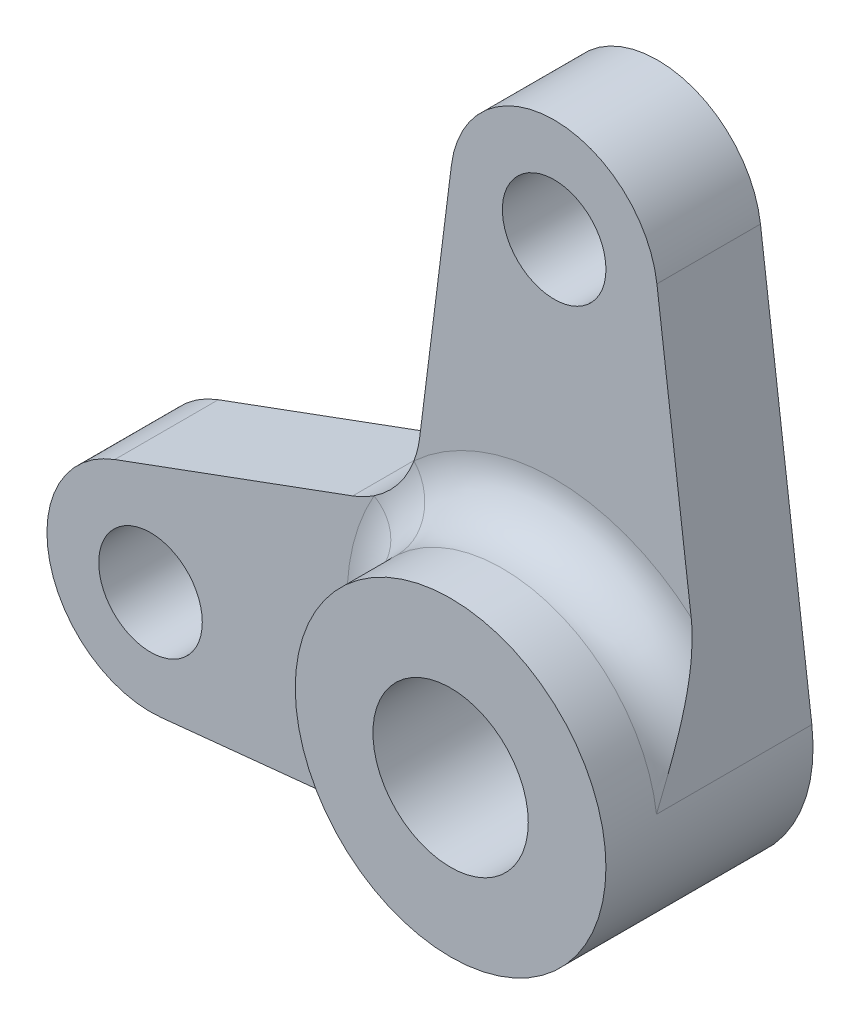
ISO-10303-21;
HEADER;
FILE_DESCRIPTION(('STEP AP214'),'2;1');
FILE_NAME('part.step','',(''),(''),'','','');
FILE_SCHEMA(('AUTOMOTIVE_DESIGN { 1 0 10303 214 1 1 1 1 }'));
ENDSEC;
DATA;
#1=APPLICATION_CONTEXT('core data for automotive mechanical design processes');
#2=APPLICATION_PROTOCOL_DEFINITION('international standard','automotive_design',2000,#1);
#3=PRODUCT_CONTEXT('',#1,'mechanical');
#4=PRODUCT('Part','Part','',(#3));
#5=PRODUCT_RELATED_PRODUCT_CATEGORY('part','',(#4));
#6=PRODUCT_DEFINITION_FORMATION('','',#4);
#7=PRODUCT_DEFINITION_CONTEXT('part definition',#1,'design');
#8=PRODUCT_DEFINITION('design','',#6,#7);
#9=PRODUCT_DEFINITION_SHAPE('','',#8);
#10=(LENGTH_UNIT() NAMED_UNIT(*) SI_UNIT(.MILLI.,.METRE.));
#11=(NAMED_UNIT(*) PLANE_ANGLE_UNIT() SI_UNIT($,.RADIAN.));
#12=(NAMED_UNIT(*) SI_UNIT($,.STERADIAN.) SOLID_ANGLE_UNIT());
#13=UNCERTAINTY_MEASURE_WITH_UNIT(LENGTH_MEASURE(1.E-05),#10,'distance_accuracy_value','');
#14=(GEOMETRIC_REPRESENTATION_CONTEXT(3) GLOBAL_UNCERTAINTY_ASSIGNED_CONTEXT((#13)) GLOBAL_UNIT_ASSIGNED_CONTEXT((#10,
#11,#12)) REPRESENTATION_CONTEXT('',''));
#15=CARTESIAN_POINT('',(0.,0.,0.));
#16=DIRECTION('',(0.,0.,1.));
#17=DIRECTION('',(1.,0.,0.));
#18=AXIS2_PLACEMENT_3D('',#15,#16,#17);
#19=CARTESIAN_POINT('',(0.,0.,4.));
#20=DIRECTION('',(0.,0.,1.));
#21=DIRECTION('',(1.,0.,0.));
#22=AXIS2_PLACEMENT_3D('',#19,#20,#21);
#23=PLANE('',#22);
#24=CARTESIAN_POINT('',(-15.5899210365638,-3.5992168695018,4.));
#25=DIRECTION('',(0.,0.,1.));
#26=DIRECTION('',(1.,0.,0.));
#27=AXIS2_PLACEMENT_3D('',#24,#25,#26);
#28=CIRCLE('',#27,2.);
#29=CARTESIAN_POINT('',(-13.5899210365638,-3.5992168695018,4.));
#30=VERTEX_POINT('',#29);
#31=EDGE_CURVE('E178',#30,#30,#28,.T.);
#32=ORIENTED_EDGE('',*,*,#31,.F.);
#33=EDGE_LOOP('',(#32));
#34=FACE_BOUND('',#33,.T.);
#35=DIRECTION('',(0.994846710430843,0.101390447010209,0.));
#36=VECTOR('',#35,1.);
#37=CARTESIAN_POINT('',(0.608342682061253,-5.96908026258506,4.));
#38=LINE('',#37,#36);
#39=CARTESIAN_POINT('',(-15.1843592485229,-7.57860371122517,4.));
#40=VERTEX_POINT('',#39);
#41=CARTESIAN_POINT('',(-4.65589129480014,-6.50558807879843,4.));
#42=VERTEX_POINT('',#41);
#43=EDGE_CURVE('E162',#40,#42,#38,.T.);
#44=ORIENTED_EDGE('',*,*,#43,.T.);
#45=CARTESIAN_POINT('',(0.,0.,4.));
#46=DIRECTION('',(0.,0.,1.));
#47=DIRECTION('',(1.,0.,0.));
#48=AXIS2_PLACEMENT_3D('',#45,#46,#47);
#49=CIRCLE('',#48,8.);
#50=CARTESIAN_POINT('',(-6.95769333526124,3.94848115766796,4.));
#51=VERTEX_POINT('',#50);
#52=EDGE_CURVE('E155',#42,#51,#49,.F.);
#53=ORIENTED_EDGE('',*,*,#52,.T.);
#54=CARTESIAN_POINT('',(-9.16098033657612,7.2869727916004,4.));
#55=DIRECTION('',(0.,0.,1.));
#56=DIRECTION('',(1.,0.,0.));
#57=AXIS2_PLACEMENT_3D('',#54,#55,#56);
#58=CIRCLE('',#57,4.);
#59=CARTESIAN_POINT('',(-7.78104848375006,3.53253700422088,4.));
#60=VERTEX_POINT('',#59);
#61=EDGE_CURVE('E140',#60,#51,#58,.T.);
#62=ORIENTED_EDGE('',*,*,#61,.F.);
#63=DIRECTION('',(0.938608946844878,0.344982963206518,0.));
#64=VECTOR('',#63,1.);
#65=CARTESIAN_POINT('',(-2.06989777923911,5.63165368106927,4.));
#66=LINE('',#65,#64);
#67=CARTESIAN_POINT('',(-16.9698528893898,0.155218917877715,4.));
#68=VERTEX_POINT('',#67);
#69=EDGE_CURVE('E153',#68,#60,#66,.T.);
#70=ORIENTED_EDGE('',*,*,#69,.F.);
#71=CARTESIAN_POINT('',(-15.5899210365638,-3.5992168695018,4.));
#72=DIRECTION('',(0.,0.,1.));
#73=DIRECTION('',(1.,0.,0.));
#74=AXIS2_PLACEMENT_3D('',#71,#72,#73);
#75=CIRCLE('',#74,4.);
#76=EDGE_CURVE('E160',#68,#40,#75,.T.);
#77=ORIENTED_EDGE('',*,*,#76,.T.);
#78=EDGE_LOOP('',(#44,#53,#62,#70,#77));
#79=FACE_BOUND('',#78,.T.);
#80=ADVANCED_FACE('F46',(#34,#79),#23,.T.);
#81=CARTESIAN_POINT('',(-9.16098033657612,7.2869727916004,4.));
#82=DIRECTION('',(0.,0.,-1.));
#83=DIRECTION('',(-1.,0.,0.));
#84=AXIS2_PLACEMENT_3D('',#81,#82,#83);
#85=CYLINDRICAL_SURFACE('',#84,4.);
#86=CARTESIAN_POINT('',(-9.16098033657612,7.2869727916004,0.));
#87=DIRECTION('',(0.,0.,1.));
#88=DIRECTION('',(1.,0.,0.));
#89=AXIS2_PLACEMENT_3D('',#86,#87,#88);
#90=CIRCLE('',#89,4.);
#91=CARTESIAN_POINT('',(-7.78104848375006,3.53253700422088,0.));
#92=VERTEX_POINT('',#91);
#93=CARTESIAN_POINT('',(-5.19235336997923,6.78697279160042,0.));
#94=VERTEX_POINT('',#93);
#95=EDGE_CURVE('E143',#92,#94,#90,.T.);
#96=ORIENTED_EDGE('',*,*,#95,.F.);
#97=DIRECTION('',(0.,0.,-1.));
#98=VECTOR('',#97,1.);
#99=CARTESIAN_POINT('',(-7.78104848375006,3.53253700422088,4.));
#100=LINE('',#99,#98);
#101=EDGE_CURVE('E137',#60,#92,#100,.T.);
#102=ORIENTED_EDGE('',*,*,#101,.F.);
#103=ORIENTED_EDGE('',*,*,#61,.T.);
#104=CARTESIAN_POINT('',(-5.41242229296837,5.89115310636033,4.));
#105=VERTEX_POINT('',#104);
#106=EDGE_CURVE('E156',#51,#105,#58,.T.);
#107=ORIENTED_EDGE('',*,*,#106,.T.);
#108=CARTESIAN_POINT('',(-5.19235336997923,6.78697279160042,4.));
#109=VERTEX_POINT('',#108);
#110=EDGE_CURVE('E76',#105,#109,#58,.T.);
#111=ORIENTED_EDGE('',*,*,#110,.T.);
#112=DIRECTION('',(0.,0.,-1.));
#113=VECTOR('',#112,1.);
#114=CARTESIAN_POINT('',(-5.19235336997923,6.78697279160042,4.));
#115=LINE('',#114,#113);
#116=EDGE_CURVE('E181',#109,#94,#115,.T.);
#117=ORIENTED_EDGE('',*,*,#116,.T.);
#118=EDGE_LOOP('',(#96,#102,#103,#107,#111,#117));
#119=FACE_BOUND('',#118,.T.);
#120=ADVANCED_FACE('F139',(#119),#85,.F.);
#121=CARTESIAN_POINT('',(-2.06989777923911,5.63165368106927,4.));
#122=DIRECTION('',(-0.344982963206518,0.938608946844878,0.));
#123=DIRECTION('',(-0.938608946844878,-0.344982963206518,0.));
#124=AXIS2_PLACEMENT_3D('',#121,#122,#123);
#125=PLANE('',#124);
#126=DIRECTION('',(0.938608946844878,0.344982963206518,0.));
#127=VECTOR('',#126,1.);
#128=CARTESIAN_POINT('',(-2.06989777923911,5.63165368106927,0.));
#129=LINE('',#128,#127);
#130=CARTESIAN_POINT('',(-16.9698528893898,0.155218917877715,0.));
#131=VERTEX_POINT('',#130);
#132=EDGE_CURVE('E183',#131,#92,#129,.T.);
#133=ORIENTED_EDGE('',*,*,#132,.F.);
#134=DIRECTION('',(0.,0.,-1.));
#135=VECTOR('',#134,1.);
#136=CARTESIAN_POINT('',(-16.9698528893898,0.155218917877715,4.));
#137=LINE('',#136,#135);
#138=EDGE_CURVE('E149',#68,#131,#137,.T.);
#139=ORIENTED_EDGE('',*,*,#138,.F.);
#140=ORIENTED_EDGE('',*,*,#69,.T.);
#141=ORIENTED_EDGE('',*,*,#101,.T.);
#142=EDGE_LOOP('',(#133,#139,#140,#141));
#143=FACE_BOUND('',#142,.T.);
#144=ADVANCED_FACE('F158',(#143),#125,.T.);
#145=CARTESIAN_POINT('',(-15.5899210365638,-3.5992168695018,4.));
#146=DIRECTION('',(0.,0.,-1.));
#147=DIRECTION('',(-1.,0.,0.));
#148=AXIS2_PLACEMENT_3D('',#145,#146,#147);
#149=CYLINDRICAL_SURFACE('',#148,4.);
#150=CARTESIAN_POINT('',(-15.5899210365638,-3.5992168695018,0.));
#151=DIRECTION('',(0.,0.,1.));
#152=DIRECTION('',(1.,0.,0.));
#153=AXIS2_PLACEMENT_3D('',#150,#151,#152);
#154=CIRCLE('',#153,4.);
#155=CARTESIAN_POINT('',(-15.1843592485229,-7.57860371122517,0.));
#156=VERTEX_POINT('',#155);
#157=EDGE_CURVE('E186',#131,#156,#154,.T.);
#158=ORIENTED_EDGE('',*,*,#157,.T.);
#159=DIRECTION('',(0.,0.,-1.));
#160=VECTOR('',#159,1.);
#161=CARTESIAN_POINT('',(-15.1843592485229,-7.57860371122517,4.));
#162=LINE('',#161,#160);
#163=EDGE_CURVE('E221',#40,#156,#162,.T.);
#164=ORIENTED_EDGE('',*,*,#163,.F.);
#165=ORIENTED_EDGE('',*,*,#76,.F.);
#166=ORIENTED_EDGE('',*,*,#138,.T.);
#167=EDGE_LOOP('',(#158,#164,#165,#166));
#168=FACE_BOUND('',#167,.T.);
#169=ADVANCED_FACE('F328',(#168),#149,.T.);
#170=CARTESIAN_POINT('',(0.608342682061253,-5.96908026258506,4.));
#171=DIRECTION('',(-0.101390447010209,0.994846710430843,0.));
#172=DIRECTION('',(-0.994846710430843,-0.101390447010209,0.));
#173=AXIS2_PLACEMENT_3D('',#170,#171,#172);
#174=PLANE('',#173);
#175=DIRECTION('',(0.994846710430843,0.101390447010209,0.));
#176=VECTOR('',#175,1.);
#177=CARTESIAN_POINT('',(0.608342682061253,-5.96908026258506,0.));
#178=LINE('',#177,#176);
#179=CARTESIAN_POINT('',(0.608342682061253,-5.96908026258506,0.));
#180=VERTEX_POINT('',#179);
#181=EDGE_CURVE('E188',#156,#180,#178,.T.);
#182=ORIENTED_EDGE('',*,*,#181,.T.);
#183=DIRECTION('',(0.,0.,-1.));
#184=VECTOR('',#183,1.);
#185=CARTESIAN_POINT('',(0.608342682061253,-5.96908026258506,4.));
#186=LINE('',#185,#184);
#187=CARTESIAN_POINT('',(0.608342682061253,-5.96908026258506,6.));
#188=VERTEX_POINT('',#187);
#189=EDGE_CURVE('E218',#188,#180,#186,.T.);
#190=ORIENTED_EDGE('',*,*,#189,.F.);
#191=CARTESIAN_POINT('',(-4.65589129480014,-6.50558807879843,4.));
#192=CARTESIAN_POINT('',(-4.50550869242852,-6.49026173845157,4.00003932371851));
#193=CARTESIAN_POINT('',(-4.35530386111236,-6.47495351575699,4.007490808616));
#194=CARTESIAN_POINT('',(-4.05637901781883,-6.44448839669271,4.03529748814425));
#195=CARTESIAN_POINT('',(-3.90765651818151,-6.42933124679152,4.05562506504847));
#196=CARTESIAN_POINT('',(-3.61429208950946,-6.39943282098573,4.10690972129832));
#197=CARTESIAN_POINT('',(-3.46962222490916,-6.38468869800986,4.13771036698707));
#198=CARTESIAN_POINT('',(-3.18246014765321,-6.35542238886687,4.20848018103587));
#199=CARTESIAN_POINT('',(-3.03996925239694,-6.34090033696335,4.24845467894672));
#200=CARTESIAN_POINT('',(-2.59022340870194,-6.29506419793297,4.38804779430897));
#201=CARTESIAN_POINT('',(-2.28745635803162,-6.26420749781469,4.50228369716509));
#202=CARTESIAN_POINT('',(-1.69252803222661,-6.20357499206284,4.7558081690687));
#203=CARTESIAN_POINT('',(-1.40037944276738,-6.17380047929811,4.89512559194425));
#204=CARTESIAN_POINT('',(-0.532179269195651,-6.08531729614052,5.33812108027676));
#205=CARTESIAN_POINT('',(0.03166547377275,-6.02785269387113,5.66533067273494));
#206=CARTESIAN_POINT('',(0.599444526663096,-5.96998712385718,5.99483605454544));
#207=CARTESIAN_POINT('',(0.603893616553208,-5.96953369197866,5.99741804396528));
#208=CARTESIAN_POINT('',(0.608342682061253,-5.96908026258506,6.));
#209=B_SPLINE_CURVE_WITH_KNOTS('',3,(#191,#192,#193,#194,#195,#196,#197,#198,#199,#200,#201,
#202,#203,#204,#205,#206,#207,#208),.UNSPECIFIED.,.F.,.F.,(4,2,2,2,2,2,2,2,4),(0.,
0.453047985172762,0.905127510165716,1.35073120961544,1.79659444088085,2.76988627914198,
3.74430503334819,5.70583133706968,5.72132327058453),.UNSPECIFIED.);
#210=EDGE_CURVE('E61',#188,#42,#209,.F.);
#211=ORIENTED_EDGE('',*,*,#210,.T.);
#212=ORIENTED_EDGE('',*,*,#43,.F.);
#213=ORIENTED_EDGE('',*,*,#163,.T.);
#214=EDGE_LOOP('',(#182,#190,#211,#212,#213));
#215=FACE_BOUND('',#214,.T.);
#216=ADVANCED_FACE('F332',(#215),#174,.F.);
#217=CARTESIAN_POINT('',(0.,0.,4.));
#218=DIRECTION('',(0.,0.,-1.));
#219=DIRECTION('',(-1.,0.,0.));
#220=AXIS2_PLACEMENT_3D('',#217,#218,#219);
#221=CYLINDRICAL_SURFACE('',#220,6.);
#222=CARTESIAN_POINT('',(0.,0.,6.));
#223=DIRECTION('',(0.,0.,1.));
#224=DIRECTION('',(1.,0.,0.));
#225=AXIS2_PLACEMENT_3D('',#222,#223,#224);
#226=CIRCLE('',#225,6.);
#227=CARTESIAN_POINT('',(-5.21827000144603,2.96136086825103,6.));
#228=VERTEX_POINT('',#227);
#229=EDGE_CURVE('E235',#228,#188,#226,.T.);
#230=ORIENTED_EDGE('',*,*,#229,.T.);
#231=ORIENTED_EDGE('',*,*,#189,.T.);
#232=CARTESIAN_POINT('',(0.,0.,0.));
#233=DIRECTION('',(0.,0.,1.));
#234=DIRECTION('',(1.,0.,0.));
#235=AXIS2_PLACEMENT_3D('',#232,#233,#234);
#236=CIRCLE('',#235,6.);
#237=CARTESIAN_POINT('',(5.95294044989533,0.75,0.));
#238=VERTEX_POINT('',#237);
#239=EDGE_CURVE('E190',#180,#238,#236,.T.);
#240=ORIENTED_EDGE('',*,*,#239,.T.);
#241=DIRECTION('',(0.,0.,-1.));
#242=VECTOR('',#241,1.);
#243=CARTESIAN_POINT('',(5.95294044989533,0.75,4.));
#244=LINE('',#243,#242);
#245=CARTESIAN_POINT('',(5.95294044989533,0.75,6.));
#246=VERTEX_POINT('',#245);
#247=EDGE_CURVE('E216',#246,#238,#244,.T.);
#248=ORIENTED_EDGE('',*,*,#247,.F.);
#249=CARTESIAN_POINT('',(0.,0.,6.));
#250=DIRECTION('',(0.,0.,1.));
#251=DIRECTION('',(1.,0.,0.));
#252=AXIS2_PLACEMENT_3D('',#249,#250,#251);
#253=CIRCLE('',#252,6.);
#254=CARTESIAN_POINT('',(-4.05931671972628,4.41836482977025,6.));
#255=VERTEX_POINT('',#254);
#256=EDGE_CURVE('E148',#246,#255,#253,.T.);
#257=ORIENTED_EDGE('',*,*,#256,.T.);
#258=CARTESIAN_POINT('',(-7.09205040802457,3.86359303604542,4.));
#259=CARTESIAN_POINT('',(-5.26263923908777,2.88215412559389,3.92102604173649));
#260=CARTESIAN_POINT('',(-5.28476820630238,2.84099014529362,5.99804801600606));
#261=CARTESIAN_POINT('',(-7.05676602148216,3.88491694339447,4.));
#262=CARTESIAN_POINT('',(-5.25215997481038,2.90105243405474,3.94322691102971));
#263=CARTESIAN_POINT('',(-5.26738218713554,2.87333161374704,5.9991488727043));
#264=CARTESIAN_POINT('',(-7.02096007862821,3.90730188776831,4.));
#265=CARTESIAN_POINT('',(-5.24056669321657,2.92187758629736,3.96461618808966));
#266=CARTESIAN_POINT('',(-5.24969684991369,2.90551751523541,5.99973871054832));
#267=CARTESIAN_POINT('',(-6.94853160704356,3.95426604568904,4.));
#268=CARTESIAN_POINT('',(-5.21530198986082,2.96667578101325,4.00527581445257));
#269=CARTESIAN_POINT('',(-5.21373935420304,2.96955719088566,6.00012073698631));
#270=CARTESIAN_POINT('',(-6.91190919213209,3.97884495480641,4.));
#271=CARTESIAN_POINT('',(-5.20164432136167,2.99062987499532,4.02457936009962));
#272=CARTESIAN_POINT('',(-5.19546727735346,3.00141101044355,5.9999130360774));
#273=CARTESIAN_POINT('',(-6.80115717853336,4.05597961402331,4.));
#274=CARTESIAN_POINT('',(-5.15782926178611,3.06612140683166,4.07880156858457));
#275=CARTESIAN_POINT('',(-5.13978892926876,3.09644322772052,5.9984305162134));
#276=CARTESIAN_POINT('',(-6.72612813476004,4.11194199380124,4.));
#277=CARTESIAN_POINT('',(-5.12446419694023,3.12196405408475,4.11074583870072));
#278=CARTESIAN_POINT('',(-5.10151339089911,3.15910568287659,5.99629654790629));
#279=CARTESIAN_POINT('',(-6.57587746126691,4.23303489159353,4.));
#280=CARTESIAN_POINT('',(-5.05051200865963,3.24031502441396,4.16481581351819));
#281=CARTESIAN_POINT('',(-5.02272010125789,3.28293562379939,5.9913675403719));
#282=CARTESIAN_POINT('',(-6.50065595626507,4.29816048155983,4.));
#283=CARTESIAN_POINT('',(-5.00988697683538,3.30295730261187,4.18719542018186));
#284=CARTESIAN_POINT('',(-4.98220356227642,3.34410389253411,5.98857285593705));
#285=CARTESIAN_POINT('',(-6.35243058856001,4.43699963128022,4.));
#286=CARTESIAN_POINT('',(-4.92274167368913,3.43135698331047,4.2222372176033));
#287=CARTESIAN_POINT('',(-4.89894642691672,3.4649250317025,5.98363488218695));
#288=CARTESIAN_POINT('',(-6.27942669327432,4.5107130647794,4.));
#289=CARTESIAN_POINT('',(-4.876069699923,3.49739308623546,4.23508014567264));
#290=CARTESIAN_POINT('',(-4.85620586324029,3.5245779243989,5.981491583297));
#291=CARTESIAN_POINT('',(-6.1391285881322,4.66417638292821,4.));
#292=CARTESIAN_POINT('',(-4.77922310560951,3.62846104809209,4.25116681386695));
#293=CARTESIAN_POINT('',(-4.76918036793096,3.64144893892005,5.97871974434953));
#294=CARTESIAN_POINT('',(-6.07176771521666,4.74382500051056,4.));
#295=CARTESIAN_POINT('',(-4.72887736420724,3.69383237352337,4.25463016975214));
#296=CARTESIAN_POINT('',(-4.72492621735327,3.69868966809375,5.97807000434221));
#297=CARTESIAN_POINT('',(-5.94367276386999,4.90794595739762,4.));
#298=CARTESIAN_POINT('',(-4.62606376183682,3.82182624533207,4.25249574347233));
#299=CARTESIAN_POINT('',(-4.63437711175882,3.81153277825736,5.9784568473535));
#300=CARTESIAN_POINT('',(-5.88293888232376,4.99241843990365,4.));
#301=CARTESIAN_POINT('',(-4.57331660629623,3.88479290893881,4.24688617490573));
#302=CARTESIAN_POINT('',(-4.58808209616624,3.86713511053545,5.97949348045894));
#303=CARTESIAN_POINT('',(-5.76953330896459,5.16361775218782,4.));
#304=CARTESIAN_POINT('',(-4.46797602260671,4.00563040916351,4.2266169638638));
#305=CARTESIAN_POINT('',(-4.49353177936476,3.97660694385085,5.98287587258836));
#306=CARTESIAN_POINT('',(-5.71686046612424,5.25034425804359,4.));
#307=CARTESIAN_POINT('',(-4.4151099105232,4.06378539819822,4.21185198075913));
#308=CARTESIAN_POINT('',(-4.44527675927037,4.03047669141289,5.98522144448768));
#309=CARTESIAN_POINT('',(-5.62020134297215,5.42344903870027,4.));
#310=CARTESIAN_POINT('',(-4.31209738556276,4.17301037702442,4.17322570496803));
#311=CARTESIAN_POINT('',(-4.34686054498577,4.13642735008801,5.99029931438942));
#312=CARTESIAN_POINT('',(-5.57621446993235,5.50982733686846,4.));
#313=CARTESIAN_POINT('',(-4.26174255546994,4.22425531917974,4.1491754191504));
#314=CARTESIAN_POINT('',(-4.29669948114217,4.18850838306196,5.99303158598172));
#315=CARTESIAN_POINT('',(-5.50157431593796,5.66969681830402,4.));
#316=CARTESIAN_POINT('',(-4.17244364287663,4.31227645265462,4.0955858401042));
#317=CARTESIAN_POINT('',(-4.20064866061757,4.28469349644599,5.99727742454717));
#318=CARTESIAN_POINT('',(-5.46995424843841,5.74349013687676,4.));
#319=CARTESIAN_POINT('',(-4.13271625685636,4.35015216354301,4.06683043524388));
#320=CARTESIAN_POINT('',(-4.15496913267484,4.3290045727185,5.99889792513555));
#321=CARTESIAN_POINT('',(-5.41292544646037,5.88765504521861,4.));
#322=CARTESIAN_POINT('',(-4.05983837366413,4.41815011066195,4.00280675781539));
#323=CARTESIAN_POINT('',(-4.06224325912871,4.41613239067403,6.00032309347067));
#324=CARTESIAN_POINT('',(-5.38751249986295,5.95802892927471,4.));
#325=CARTESIAN_POINT('',(-4.02671177108834,4.44822438030127,3.96736434304045));
#326=CARTESIAN_POINT('',(-4.01519786478632,4.45895012872038,6.00012899612639));
#327=CARTESIAN_POINT('',(-5.34206821510501,6.09485200799386,4.));
#328=CARTESIAN_POINT('',(-3.96924754404223,4.50004403742999,3.8906155150814));
#329=CARTESIAN_POINT('',(-3.9194543773772,4.54334368489482,5.9967453404874));
#330=CARTESIAN_POINT('',(-5.32207589566726,6.16127019400992,4.));
#331=CARTESIAN_POINT('',(-3.94510963192175,4.52159874890455,3.84911393255154));
#332=CARTESIAN_POINT('',(-3.87074700294776,4.58490867869363,5.9935347701561));
#333=CARTESIAN_POINT('',(-5.28689356628276,6.28905429513437,4.));
#334=CARTESIAN_POINT('',(-3.90826504445343,4.55583343423496,3.76227402785057));
#335=CARTESIAN_POINT('',(-3.77209607106146,4.66641283899891,5.98284171335297));
#336=CARTESIAN_POINT('',(-5.27171306764895,6.35041002870931,4.));
#337=CARTESIAN_POINT('',(-3.89580943727872,4.56831962327928,3.71683145444251));
#338=CARTESIAN_POINT('',(-3.72215027309313,4.70634865115006,5.97535084707453));
#339=CARTESIAN_POINT('',(-5.25856733170403,6.40880837680939,4.));
#340=CARTESIAN_POINT('',(-3.89058969219448,4.57601217208718,3.67118361840747));
#341=CARTESIAN_POINT('',(-3.67173167905991,4.74535419931831,5.96509935595014));
#342=(BOUNDED_SURFACE() B_SPLINE_SURFACE(3,2,((#258,#259,#260),(#261,#262,#263),(#264,#265,
#266),(#267,#268,#269),(#270,#271,#272),(#273,#274,#275),(#276,#277,#278),(#279,#280,#281),
(#282,#283,#284),(#285,#286,#287),(#288,#289,#290),(#291,#292,#293),(#294,#295,#296),(#297,#298,
#299),(#300,#301,#302),(#303,#304,#305),(#306,#307,#308),(#309,#310,#311),(#312,#313,#314),
(#315,#316,#317),(#318,#319,#320),(#321,#322,#323),(#324,#325,#326),(#327,#328,#329),(#330,#331,
#332),(#333,#334,#335),(#336,#337,#338),(#339,#340,#341)),.UNSPECIFIED.,.F.,.F.,
.F.) B_SPLINE_SURFACE_WITH_KNOTS((4,2,2,2,2,2,2,2,2,2,2,2,2,4),(3,3),(0.,0.146898175512561,
0.293775999363216,0.587471303990321,0.881009256417466,1.17454289391593,1.46388360856128,
1.75323291704787,2.04254087101902,2.33182907587215,2.58638533673084,2.84076837414066,
3.0969366250753,3.35360811960823),(0.,1.),
.UNSPECIFIED.) GEOMETRIC_REPRESENTATION_ITEM() RATIONAL_B_SPLINE_SURFACE(((1.,0.693533457056081,
1.),(1.,0.697265976687317,1.),(1.,0.700923895326143,1.),(1.,0.708032811301058,1.),(1.,
0.711483837234361,1.),(1.,0.72144018933077,1.),(1.,0.72755037001264,1.),(1.,0.738292726851902,
1.),(1.,0.742925693121176,1.),(1.,0.750375545746845,1.),(1.,0.753192458798123,1.),(1.,
0.756762097338074,1.),(1.,0.757543733536882,1.),(1.,0.757064315707928,1.),(1.,0.755803201008596,
1.),(1.,0.751338390959058,1.),(1.,0.74813497327302,1.),(1.,0.740028748881523,1.),(1.,
0.735126058196908,1.),(1.,0.724638605925472,1.),(1.,0.719206403147048,1.),(1.,0.707577691313514,
1.),(1.,0.701381704878045,1.),(1.,0.688476394340137,1.),(1.,0.681763772878842,1.),(1.,
0.668164568146643,1.),(1.,0.661277669032902,1.),(1.,0.654468168254256,1.))) REPRESENTATION_ITEM('') SURFACE());
#343=CARTESIAN_POINT('',(-3.67173167905991,4.74535419931831,5.96509935595014));
#344=CARTESIAN_POINT('',(-3.72215027309313,4.70634865115006,5.97535084707453));
#345=CARTESIAN_POINT('',(-3.77209607106146,4.66641283899891,5.98284171335297));
#346=CARTESIAN_POINT('',(-3.87074700294776,4.58490867869363,5.9935347701561));
#347=CARTESIAN_POINT('',(-3.9194543773772,4.54334368489482,5.9967453404874));
#348=CARTESIAN_POINT('',(-4.01519786478632,4.45895012872038,6.00012899612639));
#349=CARTESIAN_POINT('',(-4.06224325912871,4.41613239067403,6.00032309347067));
#350=CARTESIAN_POINT('',(-4.15496913267484,4.3290045727185,5.99889792513555));
#351=CARTESIAN_POINT('',(-4.20064866061757,4.28469349644599,5.99727742454717));
#352=CARTESIAN_POINT('',(-4.29669948114217,4.18850838306196,5.99303158598172));
#353=CARTESIAN_POINT('',(-4.34686054498577,4.13642735008801,5.99029931438942));
#354=CARTESIAN_POINT('',(-4.44527675927037,4.03047669141289,5.98522144448768));
#355=CARTESIAN_POINT('',(-4.49353177936476,3.97660694385085,5.98287587258836));
#356=CARTESIAN_POINT('',(-4.58808209616624,3.86713511053545,5.97949348045894));
#357=CARTESIAN_POINT('',(-4.63437711175882,3.81153277825736,5.9784568473535));
#358=CARTESIAN_POINT('',(-4.72492621735327,3.69868966809375,5.97807000434221));
#359=CARTESIAN_POINT('',(-4.76918036793096,3.64144893892005,5.97871974434953));
#360=CARTESIAN_POINT('',(-4.85620586324029,3.5245779243989,5.981491583297));
#361=CARTESIAN_POINT('',(-4.89894642691672,3.4649250317025,5.98363488218695));
#362=CARTESIAN_POINT('',(-4.98220356227642,3.34410389253411,5.98857285593704));
#363=CARTESIAN_POINT('',(-5.02272010125788,3.28293562379939,5.9913675403719));
#364=CARTESIAN_POINT('',(-5.10151339089911,3.15910568287659,5.99629654790629));
#365=CARTESIAN_POINT('',(-5.13978892926876,3.09644322772052,5.9984305162134));
#366=CARTESIAN_POINT('',(-5.19546727735346,3.00141101044355,5.9999130360774));
#367=CARTESIAN_POINT('',(-5.21373935420304,2.96955719088566,6.00012073698631));
#368=CARTESIAN_POINT('',(-5.24969684991369,2.90551751523541,5.99973871054832));
#369=CARTESIAN_POINT('',(-5.26738218713554,2.87333161374704,5.9991488727043));
#370=CARTESIAN_POINT('',(-5.28476820630238,2.84099014529362,5.99804801600606));
#371=B_SPLINE_CURVE_WITH_KNOTS('',3,(#343,#344,#345,#346,#347,#348,#349,#350,#351,#352,#353,
#354,#355,#356,#357,#358,#359,#360,#361,#362,#363,#364,#365,#366,#367,#368,#369,#370),
.UNSPECIFIED.,.F.,.F.,(4,2,2,2,2,2,2,2,2,2,2,2,2,4),(0.,0.256671494532937,0.512839745467577,
0.76722278287739,1.02177904373608,1.31106724858921,1.60037520256036,1.88972451104695,
2.1790652256923,2.47259886319077,2.76613681561791,3.05983212024502,3.20670994409567,
3.35360811960823),.UNSPECIFIED.);
#372=EDGE_CURVE('E227',#255,#228,#371,.T.);
#373=ORIENTED_EDGE('',*,*,#372,.T.);
#374=EDGE_LOOP('',(#230,#231,#240,#248,#257,#373));
#375=FACE_BOUND('',#374,.T.);
#376=CARTESIAN_POINT('',(0.,0.,8.));
#377=DIRECTION('',(0.,0.,1.));
#378=DIRECTION('',(1.,0.,0.));
#379=AXIS2_PLACEMENT_3D('',#376,#377,#378);
#380=CIRCLE('',#379,6.);
#381=CARTESIAN_POINT('',(6.,0.,8.));
#382=VERTEX_POINT('',#381);
#383=EDGE_CURVE('E184',#382,#382,#380,.T.);
#384=ORIENTED_EDGE('',*,*,#383,.F.);
#385=EDGE_LOOP('',(#384));
#386=FACE_BOUND('',#385,.T.);
#387=ADVANCED_FACE('F237',(#375,#386),#221,.T.);
#388=CARTESIAN_POINT('',(5.95294044989533,0.749999999999999,4.));
#389=DIRECTION('',(0.992156741649222,0.125,0.));
#390=DIRECTION('',(-0.125,0.992156741649222,0.));
#391=AXIS2_PLACEMENT_3D('',#388,#389,#390);
#392=PLANE('',#391);
#393=DIRECTION('',(0.125,-0.992156741649222,0.));
#394=VECTOR('',#393,1.);
#395=CARTESIAN_POINT('',(5.95294044989533,0.749999999999999,0.));
#396=LINE('',#395,#394);
#397=CARTESIAN_POINT('',(3.96862696659689,16.5,0.));
#398=VERTEX_POINT('',#397);
#399=EDGE_CURVE('E193',#398,#238,#396,.T.);
#400=ORIENTED_EDGE('',*,*,#399,.F.);
#401=DIRECTION('',(0.,0.,-1.));
#402=VECTOR('',#401,1.);
#403=CARTESIAN_POINT('',(3.96862696659689,16.5,4.));
#404=LINE('',#403,#402);
#405=CARTESIAN_POINT('',(3.96862696659689,16.5,4.));
#406=VERTEX_POINT('',#405);
#407=EDGE_CURVE('E214',#406,#398,#404,.T.);
#408=ORIENTED_EDGE('',*,*,#407,.F.);
#409=DIRECTION('',(0.125,-0.992156741649222,0.));
#410=VECTOR('',#409,1.);
#411=CARTESIAN_POINT('',(5.95294044989533,0.749999999999999,4.));
#412=LINE('',#411,#410);
#413=CARTESIAN_POINT('',(5.29150262212918,6.,4.));
#414=VERTEX_POINT('',#413);
#415=EDGE_CURVE('E167',#406,#414,#412,.T.);
#416=ORIENTED_EDGE('',*,*,#415,.T.);
#417=CARTESIAN_POINT('',(5.29150262212918,6.,4.));
#418=CARTESIAN_POINT('',(5.31039781985093,5.85002401756454,4.00003932371851));
#419=CARTESIAN_POINT('',(5.32927068108436,5.70022532550891,4.00749080861598));
#420=CARTESIAN_POINT('',(5.36682983971641,5.40210874592923,4.03529748814416));
#421=CARTESIAN_POINT('',(5.38551644968328,5.25378837747164,4.05562506504833));
#422=CARTESIAN_POINT('',(5.42237695613068,4.96121717769249,4.10690972129812));
#423=CARTESIAN_POINT('',(5.44055436264513,4.81693848634041,4.1377103669869));
#424=CARTESIAN_POINT('',(5.47663555915579,4.53055286742183,4.20848018103578));
#425=CARTESIAN_POINT('',(5.49453918362407,4.38844725369257,4.24845467894669));
#426=CARTESIAN_POINT('',(5.55104862359353,3.93991747903239,4.38804779430894));
#427=CARTESIAN_POINT('',(5.58909054596911,3.63796908103056,4.50228369716486));
#428=CARTESIAN_POINT('',(5.66384180156044,3.04464938357706,4.7558081690691));
#429=CARTESIAN_POINT('',(5.70054954085282,2.75329073550003,4.89512559194549));
#430=CARTESIAN_POINT('',(5.80963672037384,1.88743809078573,5.33812108027495));
#431=CARTESIAN_POINT('',(5.88048240155538,1.3251179291778,5.66533067272383));
#432=CARTESIAN_POINT('',(5.95182241893327,0.758874095651007,5.99483605454524));
#433=CARTESIAN_POINT('',(5.95238143594607,0.754437035667432,5.99741804396519));
#434=CARTESIAN_POINT('',(5.95294044989533,0.749999999999999,6.));
#435=B_SPLINE_CURVE_WITH_KNOTS('',3,(#417,#418,#419,#420,#421,#422,#423,#424,#425,#426,#427,
#428,#429,#430,#431,#432,#433,#434),.UNSPECIFIED.,.F.,.F.,(4,2,2,2,2,2,2,2,4),(0.,
0.453047985172105,0.905127510164549,1.3507312096149,1.79659444088085,2.76988627914215,
3.74430503334889,5.70583133706963,5.72132327058453),.UNSPECIFIED.);
#436=EDGE_CURVE('E11',#414,#246,#435,.T.);
#437=ORIENTED_EDGE('',*,*,#436,.T.);
#438=ORIENTED_EDGE('',*,*,#247,.T.);
#439=EDGE_LOOP('',(#400,#408,#416,#437,#438));
#440=FACE_BOUND('',#439,.T.);
#441=ADVANCED_FACE('F278',(#440),#392,.T.);
#442=CARTESIAN_POINT('',(0.,16.,4.));
#443=DIRECTION('',(0.,0.,-1.));
#444=DIRECTION('',(-1.,0.,0.));
#445=AXIS2_PLACEMENT_3D('',#442,#443,#444);
#446=CYLINDRICAL_SURFACE('',#445,4.00000000000001);
#447=CARTESIAN_POINT('',(0.,16.,0.));
#448=DIRECTION('',(0.,0.,1.));
#449=DIRECTION('',(1.,0.,0.));
#450=AXIS2_PLACEMENT_3D('',#447,#448,#449);
#451=CIRCLE('',#450,4.00000000000001);
#452=CARTESIAN_POINT('',(-3.96862696659689,16.5,0.));
#453=VERTEX_POINT('',#452);
#454=EDGE_CURVE('E196',#398,#453,#451,.T.);
#455=ORIENTED_EDGE('',*,*,#454,.T.);
#456=DIRECTION('',(0.,0.,-1.));
#457=VECTOR('',#456,1.);
#458=CARTESIAN_POINT('',(-3.96862696659689,16.5,4.));
#459=LINE('',#458,#457);
#460=CARTESIAN_POINT('',(-3.96862696659689,16.5,4.));
#461=VERTEX_POINT('',#460);
#462=EDGE_CURVE('E212',#461,#453,#459,.T.);
#463=ORIENTED_EDGE('',*,*,#462,.F.);
#464=CARTESIAN_POINT('',(0.,16.,4.));
#465=DIRECTION('',(0.,0.,1.));
#466=DIRECTION('',(1.,0.,0.));
#467=AXIS2_PLACEMENT_3D('',#464,#465,#466);
#468=CIRCLE('',#467,4.00000000000001);
#469=EDGE_CURVE('E170',#406,#461,#468,.T.);
#470=ORIENTED_EDGE('',*,*,#469,.F.);
#471=ORIENTED_EDGE('',*,*,#407,.T.);
#472=EDGE_LOOP('',(#455,#463,#470,#471));
#473=FACE_BOUND('',#472,.T.);
#474=ADVANCED_FACE('F282',(#473),#446,.T.);
#475=CARTESIAN_POINT('',(0.,16.,4.));
#476=DIRECTION('',(0.,0.,-1.));
#477=DIRECTION('',(-1.,0.,0.));
#478=AXIS2_PLACEMENT_3D('',#475,#476,#477);
#479=CYLINDRICAL_SURFACE('',#478,2.00000000000001);
#480=CARTESIAN_POINT('',(0.,16.,4.));
#481=DIRECTION('',(0.,0.,1.));
#482=DIRECTION('',(1.,0.,0.));
#483=AXIS2_PLACEMENT_3D('',#480,#481,#482);
#484=CIRCLE('',#483,2.00000000000001);
#485=CARTESIAN_POINT('',(2.00000000000001,16.,4.));
#486=VERTEX_POINT('',#485);
#487=EDGE_CURVE('E175',#486,#486,#484,.T.);
#488=ORIENTED_EDGE('',*,*,#487,.T.);
#489=EDGE_LOOP('',(#488));
#490=FACE_BOUND('',#489,.T.);
#491=CARTESIAN_POINT('',(0.,16.,0.));
#492=DIRECTION('',(0.,0.,1.));
#493=DIRECTION('',(1.,0.,0.));
#494=AXIS2_PLACEMENT_3D('',#491,#492,#493);
#495=CIRCLE('',#494,2.00000000000001);
#496=CARTESIAN_POINT('',(2.00000000000001,16.,0.));
#497=VERTEX_POINT('',#496);
#498=EDGE_CURVE('E205',#497,#497,#495,.T.);
#499=ORIENTED_EDGE('',*,*,#498,.F.);
#500=EDGE_LOOP('',(#499));
#501=FACE_BOUND('',#500,.T.);
#502=ADVANCED_FACE('F286',(#490,#501),#479,.F.);
#503=CARTESIAN_POINT('',(0.,0.,4.));
#504=DIRECTION('',(0.,0.,-1.));
#505=DIRECTION('',(-1.,0.,0.));
#506=AXIS2_PLACEMENT_3D('',#503,#504,#505);
#507=CYLINDRICAL_SURFACE('',#506,3.);
#508=CARTESIAN_POINT('',(0.,0.,0.));
#509=DIRECTION('',(0.,0.,1.));
#510=DIRECTION('',(1.,0.,0.));
#511=AXIS2_PLACEMENT_3D('',#508,#509,#510);
#512=CIRCLE('',#511,3.);
#513=CARTESIAN_POINT('',(3.,0.,0.));
#514=VERTEX_POINT('',#513);
#515=EDGE_CURVE('E202',#514,#514,#512,.T.);
#516=ORIENTED_EDGE('',*,*,#515,.F.);
#517=EDGE_LOOP('',(#516));
#518=FACE_BOUND('',#517,.T.);
#519=CARTESIAN_POINT('',(0.,0.,8.));
#520=DIRECTION('',(0.,0.,1.));
#521=DIRECTION('',(1.,0.,0.));
#522=AXIS2_PLACEMENT_3D('',#519,#520,#521);
#523=CIRCLE('',#522,3.);
#524=CARTESIAN_POINT('',(3.,0.,8.));
#525=VERTEX_POINT('',#524);
#526=EDGE_CURVE('E266',#525,#525,#523,.T.);
#527=ORIENTED_EDGE('',*,*,#526,.T.);
#528=EDGE_LOOP('',(#527));
#529=FACE_BOUND('',#528,.T.);
#530=ADVANCED_FACE('F292',(#518,#529),#507,.F.);
#531=CARTESIAN_POINT('',(-5.95294044989548,0.750000000000081,4.));
#532=DIRECTION('',(-0.99215674164922,0.12500000000001,0.));
#533=DIRECTION('',(-0.12500000000001,-0.99215674164922,0.));
#534=AXIS2_PLACEMENT_3D('',#531,#532,#533);
#535=PLANE('',#534);
#536=DIRECTION('',(0.12500000000001,0.99215674164922,0.));
#537=VECTOR('',#536,1.);
#538=CARTESIAN_POINT('',(-5.95294044989548,0.750000000000081,0.));
#539=LINE('',#538,#537);
#540=EDGE_CURVE('E199',#94,#453,#539,.T.);
#541=ORIENTED_EDGE('',*,*,#540,.F.);
#542=ORIENTED_EDGE('',*,*,#116,.F.);
#543=DIRECTION('',(0.12500000000001,0.99215674164922,0.));
#544=VECTOR('',#543,1.);
#545=CARTESIAN_POINT('',(-5.95294044989548,0.750000000000081,4.));
#546=LINE('',#545,#544);
#547=EDGE_CURVE('E172',#109,#461,#546,.T.);
#548=ORIENTED_EDGE('',*,*,#547,.T.);
#549=ORIENTED_EDGE('',*,*,#462,.T.);
#550=EDGE_LOOP('',(#541,#542,#548,#549));
#551=FACE_BOUND('',#550,.T.);
#552=ADVANCED_FACE('F288',(#551),#535,.T.);
#553=CARTESIAN_POINT('',(-15.5899210365638,-3.5992168695018,4.));
#554=DIRECTION('',(0.,0.,-1.));
#555=DIRECTION('',(-1.,0.,0.));
#556=AXIS2_PLACEMENT_3D('',#553,#554,#555);
#557=CYLINDRICAL_SURFACE('',#556,2.);
#558=ORIENTED_EDGE('',*,*,#31,.T.);
#559=EDGE_LOOP('',(#558));
#560=FACE_BOUND('',#559,.T.);
#561=CARTESIAN_POINT('',(-15.5899210365638,-3.5992168695018,0.));
#562=DIRECTION('',(0.,0.,1.));
#563=DIRECTION('',(1.,0.,0.));
#564=AXIS2_PLACEMENT_3D('',#561,#562,#563);
#565=CIRCLE('',#564,2.);
#566=CARTESIAN_POINT('',(-13.5899210365638,-3.5992168695018,0.));
#567=VERTEX_POINT('',#566);
#568=EDGE_CURVE('E208',#567,#567,#565,.T.);
#569=ORIENTED_EDGE('',*,*,#568,.F.);
#570=EDGE_LOOP('',(#569));
#571=FACE_BOUND('',#570,.T.);
#572=ADVANCED_FACE('F291',(#560,#571),#557,.F.);
#573=ORIENTED_EDGE('',*,*,#110,.F.);
#574=CARTESIAN_POINT('',(0.,0.,4.));
#575=DIRECTION('',(0.,0.,1.));
#576=DIRECTION('',(1.,0.,0.));
#577=AXIS2_PLACEMENT_3D('',#574,#575,#576);
#578=CIRCLE('',#577,8.);
#579=EDGE_CURVE('E356',#105,#414,#578,.F.);
#580=ORIENTED_EDGE('',*,*,#579,.T.);
#581=ORIENTED_EDGE('',*,*,#415,.F.);
#582=ORIENTED_EDGE('',*,*,#469,.T.);
#583=ORIENTED_EDGE('',*,*,#547,.F.);
#584=EDGE_LOOP('',(#573,#580,#581,#582,#583));
#585=FACE_BOUND('',#584,.T.);
#586=ORIENTED_EDGE('',*,*,#487,.F.);
#587=EDGE_LOOP('',(#586));
#588=FACE_BOUND('',#587,.T.);
#589=ADVANCED_FACE('F257',(#585,#588),#23,.T.);
#590=CARTESIAN_POINT('',(0.,0.,0.));
#591=DIRECTION('',(0.,0.,1.));
#592=DIRECTION('',(1.,0.,0.));
#593=AXIS2_PLACEMENT_3D('',#590,#591,#592);
#594=PLANE('',#593);
#595=ORIENTED_EDGE('',*,*,#95,.T.);
#596=ORIENTED_EDGE('',*,*,#540,.T.);
#597=ORIENTED_EDGE('',*,*,#454,.F.);
#598=ORIENTED_EDGE('',*,*,#399,.T.);
#599=ORIENTED_EDGE('',*,*,#239,.F.);
#600=ORIENTED_EDGE('',*,*,#181,.F.);
#601=ORIENTED_EDGE('',*,*,#157,.F.);
#602=ORIENTED_EDGE('',*,*,#132,.T.);
#603=EDGE_LOOP('',(#595,#596,#597,#598,#599,#600,#601,#602));
#604=FACE_BOUND('',#603,.T.);
#605=ORIENTED_EDGE('',*,*,#515,.T.);
#606=EDGE_LOOP('',(#605));
#607=FACE_BOUND('',#606,.T.);
#608=ORIENTED_EDGE('',*,*,#498,.T.);
#609=EDGE_LOOP('',(#608));
#610=FACE_BOUND('',#609,.T.);
#611=ORIENTED_EDGE('',*,*,#568,.T.);
#612=EDGE_LOOP('',(#611));
#613=FACE_BOUND('',#612,.T.);
#614=ADVANCED_FACE('F302',(#604,#607,#610,#613),#594,.F.);
#615=CARTESIAN_POINT('',(0.,0.,8.));
#616=DIRECTION('',(0.,0.,1.));
#617=DIRECTION('',(1.,0.,0.));
#618=AXIS2_PLACEMENT_3D('',#615,#616,#617);
#619=PLANE('',#618);
#620=ORIENTED_EDGE('',*,*,#526,.F.);
#621=EDGE_LOOP('',(#620));
#622=FACE_BOUND('',#621,.T.);
#623=ORIENTED_EDGE('',*,*,#383,.T.);
#624=EDGE_LOOP('',(#623));
#625=FACE_BOUND('',#624,.T.);
#626=ADVANCED_FACE('F304',(#622,#625),#619,.T.);
#627=CARTESIAN_POINT('',(0.,0.,6.));
#628=DIRECTION('',(0.,0.,1.));
#629=DIRECTION('',(1.,0.,0.));
#630=AXIS2_PLACEMENT_3D('',#627,#628,#629);
#631=TOROIDAL_SURFACE('',#630,8.,2.);
#632=ORIENTED_EDGE('',*,*,#210,.F.);
#633=ORIENTED_EDGE('',*,*,#229,.F.);
#634=CARTESIAN_POINT('',(-6.95769333526124,3.94848115766796,6.));
#635=DIRECTION('',(-0.493560144708505,-0.869711666907671,0.));
#636=DIRECTION('',(0.869711666907671,-0.493560144708505,0.));
#637=AXIS2_PLACEMENT_3D('',#634,#635,#636);
#638=CIRCLE('',#637,2.);
#639=EDGE_CURVE('E263',#51,#228,#638,.T.);
#640=ORIENTED_EDGE('',*,*,#639,.F.);
#641=ORIENTED_EDGE('',*,*,#52,.F.);
#642=EDGE_LOOP('',(#632,#633,#640,#641));
#643=FACE_BOUND('',#642,.T.);
#644=ADVANCED_FACE('F48',(#643),#631,.F.);
#645=ORIENTED_EDGE('',*,*,#639,.T.);
#646=ORIENTED_EDGE('',*,*,#372,.F.);
#647=CARTESIAN_POINT('',(-5.41242229296837,5.89115310636033,6.));
#648=DIRECTION('',(-0.736394138295041,-0.676552786621047,0.));
#649=DIRECTION('',(0.676552786621047,-0.736394138295041,0.));
#650=AXIS2_PLACEMENT_3D('',#647,#648,#649);
#651=CIRCLE('',#650,2.);
#652=EDGE_CURVE('E267',#105,#255,#651,.T.);
#653=ORIENTED_EDGE('',*,*,#652,.F.);
#654=ORIENTED_EDGE('',*,*,#106,.F.);
#655=EDGE_LOOP('',(#645,#646,#653,#654));
#656=FACE_BOUND('',#655,.T.);
#657=ADVANCED_FACE('F249',(#656),#342,.F.);
#658=CARTESIAN_POINT('',(0.,0.,6.));
#659=DIRECTION('',(0.,0.,1.));
#660=DIRECTION('',(1.,0.,0.));
#661=AXIS2_PLACEMENT_3D('',#658,#659,#660);
#662=TOROIDAL_SURFACE('',#661,8.,2.);
#663=ORIENTED_EDGE('',*,*,#436,.F.);
#664=ORIENTED_EDGE('',*,*,#579,.F.);
#665=ORIENTED_EDGE('',*,*,#652,.T.);
#666=ORIENTED_EDGE('',*,*,#256,.F.);
#667=EDGE_LOOP('',(#663,#664,#665,#666));
#668=FACE_BOUND('',#667,.T.);
#669=ADVANCED_FACE('F247',(#668),#662,.F.);
#670=CLOSED_SHELL('',(#80,#120,#144,#169,#216,#387,#441,#474,#502,#530,#552,#572,#589,#614,#626,
#644,#657,#669));
#671=MANIFOLD_SOLID_BREP('B2',#670);
#672=ADVANCED_BREP_SHAPE_REPRESENTATION('',(#18,#671),#14);
#673=SHAPE_DEFINITION_REPRESENTATION(#9,#672);
ENDSEC;
END-ISO-10303-21;
